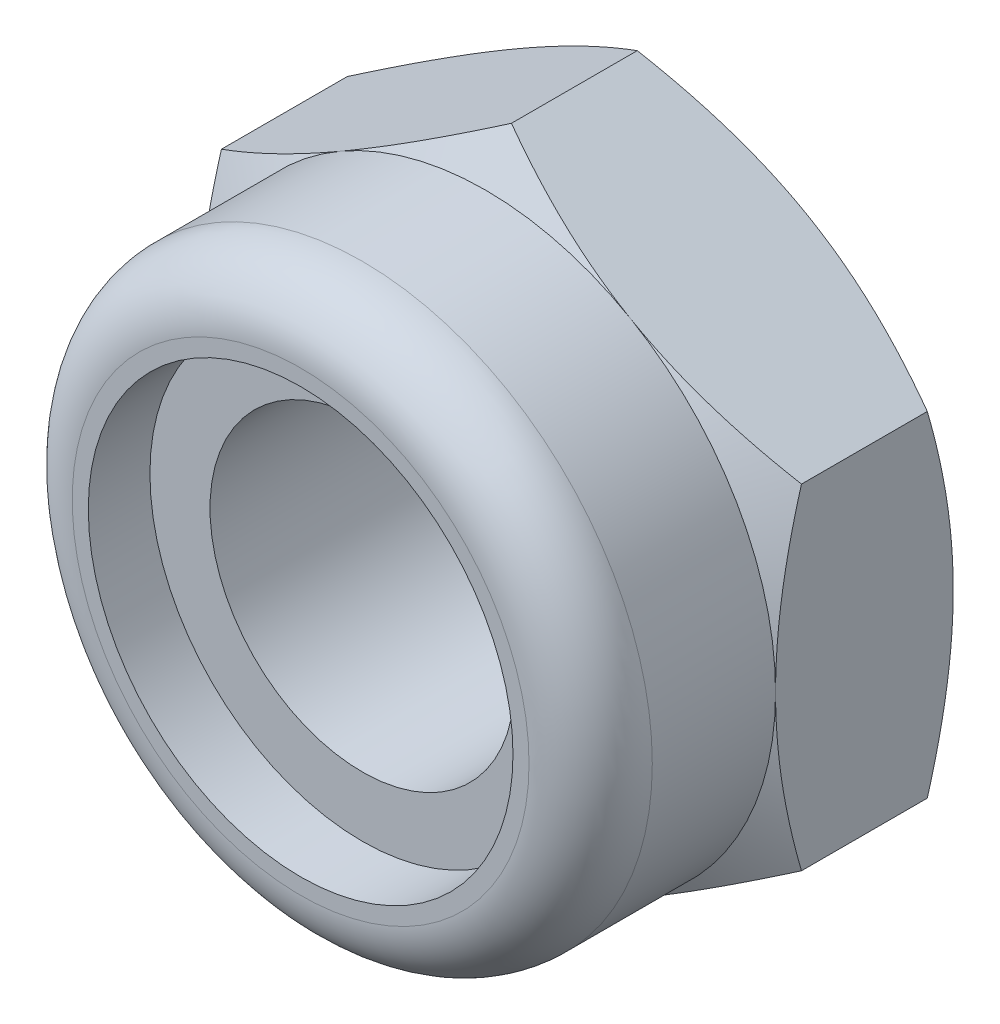
ISO-10303-21;
HEADER;
FILE_DESCRIPTION(('STEP AP214'),'2;1');
FILE_NAME('part.step','',(''),(''),'','','');
FILE_SCHEMA(('AUTOMOTIVE_DESIGN { 1 0 10303 214 1 1 1 1 }'));
ENDSEC;
DATA;
#1=APPLICATION_CONTEXT('core data for automotive mechanical design processes');
#2=APPLICATION_PROTOCOL_DEFINITION('international standard','automotive_design',2000,#1);
#3=PRODUCT_CONTEXT('',#1,'mechanical');
#4=PRODUCT('Part','Part','',(#3));
#5=PRODUCT_RELATED_PRODUCT_CATEGORY('part','',(#4));
#6=PRODUCT_DEFINITION_FORMATION('','',#4);
#7=PRODUCT_DEFINITION_CONTEXT('part definition',#1,'design');
#8=PRODUCT_DEFINITION('design','',#6,#7);
#9=PRODUCT_DEFINITION_SHAPE('','',#8);
#10=(LENGTH_UNIT() NAMED_UNIT(*) SI_UNIT(.MILLI.,.METRE.));
#11=(NAMED_UNIT(*) PLANE_ANGLE_UNIT() SI_UNIT($,.RADIAN.));
#12=(NAMED_UNIT(*) SI_UNIT($,.STERADIAN.) SOLID_ANGLE_UNIT());
#13=UNCERTAINTY_MEASURE_WITH_UNIT(LENGTH_MEASURE(1.E-05),#10,'distance_accuracy_value','');
#14=(GEOMETRIC_REPRESENTATION_CONTEXT(3) GLOBAL_UNCERTAINTY_ASSIGNED_CONTEXT((#13)) GLOBAL_UNIT_ASSIGNED_CONTEXT((#10,
#11,#12)) REPRESENTATION_CONTEXT('',''));
#15=CARTESIAN_POINT('',(0.,0.,0.));
#16=DIRECTION('',(0.,0.,1.));
#17=DIRECTION('',(1.,0.,0.));
#18=AXIS2_PLACEMENT_3D('',#15,#16,#17);
#19=CARTESIAN_POINT('',(0.,0.,-2.45));
#20=DIRECTION('',(0.,0.,1.));
#21=DIRECTION('',(1.,0.,0.));
#22=AXIS2_PLACEMENT_3D('',#19,#20,#21);
#23=CYLINDRICAL_SURFACE('',#22,2.1);
#24=CARTESIAN_POINT('',(0.,0.,1.7));
#25=DIRECTION('',(0.,0.,1.));
#26=DIRECTION('',(1.,0.,0.));
#27=AXIS2_PLACEMENT_3D('',#24,#25,#26);
#28=CIRCLE('',#27,2.1);
#29=CARTESIAN_POINT('',(2.1,0.,1.7));
#30=VERTEX_POINT('',#29);
#31=EDGE_CURVE('E267',#30,#30,#28,.T.);
#32=ORIENTED_EDGE('',*,*,#31,.T.);
#33=EDGE_LOOP('',(#32));
#34=FACE_BOUND('',#33,.T.);
#35=CARTESIAN_POINT('',(0.,0.,-2.14451698471612));
#36=DIRECTION('',(0.,0.,-1.));
#37=DIRECTION('',(-1.,0.,0.));
#38=AXIS2_PLACEMENT_3D('',#35,#36,#37);
#39=CIRCLE('',#38,2.1);
#40=CARTESIAN_POINT('',(-2.1,0.,-2.14451698471612));
#41=VERTEX_POINT('',#40);
#42=EDGE_CURVE('E21',#41,#41,#39,.F.);
#43=ORIENTED_EDGE('',*,*,#42,.F.);
#44=EDGE_LOOP('',(#43));
#45=FACE_BOUND('',#44,.T.);
#46=ADVANCED_FACE('F16',(#34,#45),#23,.F.);
#47=CARTESIAN_POINT('',(-8.,0.,-2.45));
#48=DIRECTION('',(0.,0.,1.));
#49=DIRECTION('',(1.,0.,0.));
#50=AXIS2_PLACEMENT_3D('',#47,#48,#49);
#51=PLANE('',#50);
#52=CARTESIAN_POINT('',(0.,0.,-2.45));
#53=DIRECTION('',(0.,0.,1.));
#54=DIRECTION('',(1.,0.,0.));
#55=AXIS2_PLACEMENT_3D('',#52,#53,#54);
#56=CIRCLE('',#55,4.);
#57=CARTESIAN_POINT('',(4.,0.,-2.45));
#58=VERTEX_POINT('',#57);
#59=CARTESIAN_POINT('',(2.,3.46410161513775,-2.45));
#60=VERTEX_POINT('',#59);
#61=EDGE_CURVE('E201',#58,#60,#56,.T.);
#62=ORIENTED_EDGE('',*,*,#61,.F.);
#63=CARTESIAN_POINT('',(0.,0.,-2.45));
#64=DIRECTION('',(0.,0.,1.));
#65=DIRECTION('',(1.,0.,0.));
#66=AXIS2_PLACEMENT_3D('',#63,#64,#65);
#67=CIRCLE('',#66,4.);
#68=CARTESIAN_POINT('',(2.,-3.46410161513775,-2.45));
#69=VERTEX_POINT('',#68);
#70=EDGE_CURVE('E243',#58,#69,#67,.F.);
#71=ORIENTED_EDGE('',*,*,#70,.T.);
#72=CARTESIAN_POINT('',(-2.,-3.46410161513775,-2.45));
#73=VERTEX_POINT('',#72);
#74=EDGE_CURVE('E245',#69,#73,#67,.F.);
#75=ORIENTED_EDGE('',*,*,#74,.T.);
#76=CARTESIAN_POINT('',(-4.,0.,-2.45));
#77=VERTEX_POINT('',#76);
#78=EDGE_CURVE('E568',#73,#77,#67,.F.);
#79=ORIENTED_EDGE('',*,*,#78,.T.);
#80=CARTESIAN_POINT('',(-2.,3.46410161513775,-2.45));
#81=VERTEX_POINT('',#80);
#82=EDGE_CURVE('E569',#77,#81,#67,.F.);
#83=ORIENTED_EDGE('',*,*,#82,.T.);
#84=EDGE_CURVE('E227',#81,#60,#67,.F.);
#85=ORIENTED_EDGE('',*,*,#84,.T.);
#86=EDGE_LOOP('',(#62,#71,#75,#79,#83,#85));
#87=FACE_BOUND('',#86,.T.);
#88=CARTESIAN_POINT('',(0.,0.,-2.45));
#89=DIRECTION('',(0.,0.,1.));
#90=DIRECTION('',(1.,0.,0.));
#91=AXIS2_PLACEMENT_3D('',#88,#89,#90);
#92=CIRCLE('',#91,2.5);
#93=CARTESIAN_POINT('',(2.5,0.,-2.45));
#94=VERTEX_POINT('',#93);
#95=EDGE_CURVE('E140',#94,#94,#92,.F.);
#96=ORIENTED_EDGE('',*,*,#95,.F.);
#97=EDGE_LOOP('',(#96));
#98=FACE_BOUND('',#97,.T.);
#99=ADVANCED_FACE('F207',(#87,#98),#51,.F.);
#100=CARTESIAN_POINT('',(0.,4.61880215351701,-2.45));
#101=DIRECTION('',(-0.5,0.866025403784439,0.));
#102=DIRECTION('',(-0.866025403784438,-0.5,0.));
#103=AXIS2_PLACEMENT_3D('',#100,#101,#102);
#104=PLANE('',#103);
#105=DIRECTION('',(0.,0.,1.));
#106=VECTOR('',#105,1.);
#107=CARTESIAN_POINT('',(-4.,2.3094010767585,-2.45));
#108=LINE('',#107,#106);
#109=CARTESIAN_POINT('',(-4.,2.30940107675851,-2.09273441009183));
#110=VERTEX_POINT('',#109);
#111=CARTESIAN_POINT('',(-4.,2.3094010767585,-0.357265589908164));
#112=VERTEX_POINT('',#111);
#113=EDGE_CURVE('E239',#110,#112,#108,.T.);
#114=ORIENTED_EDGE('',*,*,#113,.T.);
#115=CARTESIAN_POINT('',(-4.0002,2.30928560670467,-0.357332259074768));
#116=CARTESIAN_POINT('',(-3.82442084967677,2.41077174646171,-0.298717873648285));
#117=CARTESIAN_POINT('',(-3.64712438367362,2.513133908835,-0.245410321462265));
#118=CARTESIAN_POINT('',(-3.28946140682429,2.71963072479812,-0.152361670746405));
#119=CARTESIAN_POINT('',(-3.10908854102985,2.82376904741905,-0.112653489029706));
#120=CARTESIAN_POINT('',(-2.75057818129721,3.03075510011795,-0.0508422152802807));
#121=CARTESIAN_POINT('',(-2.57249584706486,3.13357098372492,-0.028327731522891));
#122=CARTESIAN_POINT('',(-2.21549328283349,3.33968651028529,-0.00145062314658269));
#123=CARTESIAN_POINT('',(-2.0365743503559,3.44298540411434,0.00293425857305784));
#124=CARTESIAN_POINT('',(-1.70225715780327,3.63600352522933,-0.00619007293996948));
#125=CARTESIAN_POINT('',(-1.54680884001293,3.72575165335065,-0.0174589539879952));
#126=CARTESIAN_POINT('',(-1.23692494436494,3.90466320392055,-0.0531739907981954));
#127=CARTESIAN_POINT('',(-1.08249043825587,3.99382600759479,-0.077632345711535));
#128=CARTESIAN_POINT('',(-0.771967672225421,4.17310641015197,-0.138776064919291));
#129=CARTESIAN_POINT('',(-0.615918711936897,4.26320131938131,-0.175720603654866));
#130=CARTESIAN_POINT('',(-0.30614816459616,4.44204742827551,-0.25957007254803));
#131=CARTESIAN_POINT('',(-0.15242260922622,4.53080091904967,-0.306455302212743));
#132=CARTESIAN_POINT('',(0.000200000000000402,4.61891762357085,-0.35733225907477));
#133=B_SPLINE_CURVE_WITH_KNOTS('',3,(#115,#116,#117,#118,#119,#120,#121,#122,#123,#124,#125,
#126,#127,#128,#129,#130,#131,#132),.UNSPECIFIED.,.F.,.F.,(4,2,2,2,2,2,2,2,4),(0.,
0.634047835695966,1.26961969224543,1.88946157213122,2.50854226669297,3.04757825393386,
3.58711366126904,4.13861653143764,4.68903648037743),.UNSPECIFIED.);
#134=CARTESIAN_POINT('',(-2.,3.46410161513775,0.));
#135=VERTEX_POINT('',#134);
#136=EDGE_CURVE('E43',#112,#135,#133,.T.);
#137=ORIENTED_EDGE('',*,*,#136,.T.);
#138=CARTESIAN_POINT('',(0.,4.61880215351701,-0.357265589908165));
#139=VERTEX_POINT('',#138);
#140=EDGE_CURVE('E122',#135,#139,#133,.T.);
#141=ORIENTED_EDGE('',*,*,#140,.T.);
#142=DIRECTION('',(0.,0.,1.));
#143=VECTOR('',#142,1.);
#144=CARTESIAN_POINT('',(0.,4.61880215351701,-2.45));
#145=LINE('',#144,#143);
#146=CARTESIAN_POINT('',(0.,4.61880215351701,-2.09273441009183));
#147=VERTEX_POINT('',#146);
#148=EDGE_CURVE('E119',#147,#139,#145,.T.);
#149=ORIENTED_EDGE('',*,*,#148,.F.);
#150=CARTESIAN_POINT('',(-4.0002,2.30928560670467,-2.09266774092523));
#151=CARTESIAN_POINT('',(-3.82442084967677,2.41077174646171,-2.15128212635172));
#152=CARTESIAN_POINT('',(-3.64712438367362,2.513133908835,-2.20458967853774));
#153=CARTESIAN_POINT('',(-3.28946140682429,2.71963072479812,-2.29763832925359));
#154=CARTESIAN_POINT('',(-3.10908854102985,2.82376904741905,-2.33734651097029));
#155=CARTESIAN_POINT('',(-2.75057818129721,3.03075510011795,-2.39915778471972));
#156=CARTESIAN_POINT('',(-2.57249584706486,3.13357098372492,-2.42167226847711));
#157=CARTESIAN_POINT('',(-2.21549328283349,3.33968651028529,-2.44854937685342));
#158=CARTESIAN_POINT('',(-2.0365743503559,3.44298540411434,-2.45293425857306));
#159=CARTESIAN_POINT('',(-1.70225715780327,3.63600352522933,-2.44380992706003));
#160=CARTESIAN_POINT('',(-1.54680884001293,3.72575165335065,-2.43254104601201));
#161=CARTESIAN_POINT('',(-1.23692494436494,3.90466320392055,-2.3968260092018));
#162=CARTESIAN_POINT('',(-1.08249043825587,3.99382600759479,-2.37236765428846));
#163=CARTESIAN_POINT('',(-0.771967672225421,4.17310641015197,-2.31122393508071));
#164=CARTESIAN_POINT('',(-0.615918711936897,4.26320131938131,-2.27427939634513));
#165=CARTESIAN_POINT('',(-0.306148164596159,4.44204742827551,-2.19042992745197));
#166=CARTESIAN_POINT('',(-0.15242260922622,4.53080091904967,-2.14354469778726));
#167=CARTESIAN_POINT('',(0.000200000000000404,4.61891762357085,-2.09266774092523));
#168=B_SPLINE_CURVE_WITH_KNOTS('',3,(#150,#151,#152,#153,#154,#155,#156,#157,#158,#159,#160,
#161,#162,#163,#164,#165,#166,#167),.UNSPECIFIED.,.F.,.F.,(4,2,2,2,2,2,2,2,4),(0.,
0.634047835695966,1.26961969224543,1.88946157213122,2.50854226669297,3.04757825393386,
3.58711366126904,4.13861653143764,4.68903648037743),.UNSPECIFIED.);
#169=EDGE_CURVE('E242',#81,#147,#168,.T.);
#170=ORIENTED_EDGE('',*,*,#169,.F.);
#171=EDGE_CURVE('E220',#110,#81,#168,.T.);
#172=ORIENTED_EDGE('',*,*,#171,.F.);
#173=EDGE_LOOP('',(#114,#137,#141,#149,#170,#172));
#174=FACE_BOUND('',#173,.T.);
#175=ADVANCED_FACE('F18',(#174),#104,.T.);
#176=CARTESIAN_POINT('',(4.,2.3094010767585,-2.45));
#177=DIRECTION('',(0.5,0.866025403784438,0.));
#178=DIRECTION('',(-0.866025403784438,0.5,0.));
#179=AXIS2_PLACEMENT_3D('',#176,#177,#178);
#180=PLANE('',#179);
#181=ORIENTED_EDGE('',*,*,#148,.T.);
#182=CARTESIAN_POINT('',(-0.000199999999999567,4.61891762357085,-0.35733225907477));
#183=CARTESIAN_POINT('',(0.175579150323227,4.51743148381381,-0.298717873648284));
#184=CARTESIAN_POINT('',(0.352875616326379,4.41506932144052,-0.245410321462263));
#185=CARTESIAN_POINT('',(0.710538593175704,4.20857250547739,-0.152361670746403));
#186=CARTESIAN_POINT('',(0.890911458970149,4.10443418285647,-0.112653489029704));
#187=CARTESIAN_POINT('',(1.24942181870279,3.89744813015756,-0.0508422152802783));
#188=CARTESIAN_POINT('',(1.42750415293514,3.79463224655059,-0.0283277315228876));
#189=CARTESIAN_POINT('',(1.78450671716651,3.58851671999023,-0.0014506231465804));
#190=CARTESIAN_POINT('',(1.9634256496441,3.48521782616117,0.00293425857305788));
#191=CARTESIAN_POINT('',(2.29774284219673,3.29219970504618,-0.00619007293996904));
#192=CARTESIAN_POINT('',(2.45319115998707,3.20245157692486,-0.0174589539879927));
#193=CARTESIAN_POINT('',(2.76307505563506,3.02354002635496,-0.0531739907981914));
#194=CARTESIAN_POINT('',(2.91750956174413,2.93437722268072,-0.0776323457115314));
#195=CARTESIAN_POINT('',(3.22803232777458,2.75509682012354,-0.138776064919288));
#196=CARTESIAN_POINT('',(3.3840812880631,2.6650019108942,-0.175720603654862));
#197=CARTESIAN_POINT('',(3.69385183540384,2.486155802,-0.259570072548026));
#198=CARTESIAN_POINT('',(3.84757739077378,2.39740231122585,-0.30645530221274));
#199=CARTESIAN_POINT('',(4.0002,2.30928560670467,-0.357332259074768));
#200=B_SPLINE_CURVE_WITH_KNOTS('',3,(#182,#183,#184,#185,#186,#187,#188,#189,#190,#191,#192,
#193,#194,#195,#196,#197,#198,#199),.UNSPECIFIED.,.F.,.F.,(4,2,2,2,2,2,2,2,4),(0.,
0.634047835695967,1.26961969224544,1.88946157213123,2.50854226669298,3.04757825393386,
3.58711366126904,4.13861653143764,4.68903648037744),.UNSPECIFIED.);
#201=CARTESIAN_POINT('',(2.,3.46410161513775,0.));
#202=VERTEX_POINT('',#201);
#203=EDGE_CURVE('E111',#139,#202,#200,.T.);
#204=ORIENTED_EDGE('',*,*,#203,.T.);
#205=CARTESIAN_POINT('',(4.,2.30940107675851,-0.357265589908165));
#206=VERTEX_POINT('',#205);
#207=EDGE_CURVE('E115',#202,#206,#200,.T.);
#208=ORIENTED_EDGE('',*,*,#207,.T.);
#209=DIRECTION('',(0.,0.,1.));
#210=VECTOR('',#209,1.);
#211=CARTESIAN_POINT('',(4.,2.3094010767585,-2.45));
#212=LINE('',#211,#210);
#213=CARTESIAN_POINT('',(4.,2.30940107675851,-2.09273441009183));
#214=VERTEX_POINT('',#213);
#215=EDGE_CURVE('E228',#214,#206,#212,.T.);
#216=ORIENTED_EDGE('',*,*,#215,.F.);
#217=CARTESIAN_POINT('',(-0.000199999999999567,4.61891762357085,-2.09266774092523));
#218=CARTESIAN_POINT('',(0.175579150323226,4.51743148381381,-2.15128212635172));
#219=CARTESIAN_POINT('',(0.352875616326378,4.41506932144052,-2.20458967853774));
#220=CARTESIAN_POINT('',(0.710538593175704,4.20857250547739,-2.2976383292536));
#221=CARTESIAN_POINT('',(0.890911458970149,4.10443418285647,-2.3373465109703));
#222=CARTESIAN_POINT('',(1.24942181870279,3.89744813015756,-2.39915778471972));
#223=CARTESIAN_POINT('',(1.42750415293514,3.79463224655059,-2.42167226847711));
#224=CARTESIAN_POINT('',(1.78450671716651,3.58851671999023,-2.44854937685342));
#225=CARTESIAN_POINT('',(1.9634256496441,3.48521782616117,-2.45293425857306));
#226=CARTESIAN_POINT('',(2.29774284219673,3.29219970504618,-2.44380992706003));
#227=CARTESIAN_POINT('',(2.45319115998707,3.20245157692486,-2.43254104601201));
#228=CARTESIAN_POINT('',(2.76307505563506,3.02354002635496,-2.39682600920181));
#229=CARTESIAN_POINT('',(2.91750956174413,2.93437722268072,-2.37236765428847));
#230=CARTESIAN_POINT('',(3.22803232777458,2.75509682012354,-2.31122393508071));
#231=CARTESIAN_POINT('',(3.3840812880631,2.6650019108942,-2.27427939634514));
#232=CARTESIAN_POINT('',(3.69385183540384,2.486155802,-2.19042992745197));
#233=CARTESIAN_POINT('',(3.84757739077378,2.39740231122585,-2.14354469778726));
#234=CARTESIAN_POINT('',(4.0002,2.30928560670467,-2.09266774092523));
#235=B_SPLINE_CURVE_WITH_KNOTS('',3,(#217,#218,#219,#220,#221,#222,#223,#224,#225,#226,#227,
#228,#229,#230,#231,#232,#233,#234),.UNSPECIFIED.,.F.,.F.,(4,2,2,2,2,2,2,2,4),(0.,
0.634047835695967,1.26961969224544,1.88946157213123,2.50854226669298,3.04757825393386,
3.58711366126904,4.13861653143764,4.68903648037743),.UNSPECIFIED.);
#236=EDGE_CURVE('E211',#60,#214,#235,.T.);
#237=ORIENTED_EDGE('',*,*,#236,.F.);
#238=EDGE_CURVE('E218',#147,#60,#235,.T.);
#239=ORIENTED_EDGE('',*,*,#238,.F.);
#240=EDGE_LOOP('',(#181,#204,#208,#216,#237,#239));
#241=FACE_BOUND('',#240,.T.);
#242=ADVANCED_FACE('F113',(#241),#180,.T.);
#243=CARTESIAN_POINT('',(4.,2.3094010767585,-2.45));
#244=DIRECTION('',(-1.,0.,0.));
#245=DIRECTION('',(0.,0.,1.));
#246=AXIS2_PLACEMENT_3D('',#243,#244,#245);
#247=PLANE('',#246);
#248=CARTESIAN_POINT('',(4.,-6.12487198995892,-1.91410682124064));
#249=CARTESIAN_POINT('',(4.,-5.94924937038676,-1.8292362707669));
#250=CARTESIAN_POINT('',(4.,-5.77321152095286,-1.7452094038074));
#251=CARTESIAN_POINT('',(4.,-5.42008084777955,-1.57932514679716));
#252=CARTESIAN_POINT('',(4.,-5.24298784779928,-1.49746813236723));
#253=CARTESIAN_POINT('',(4.,-4.88656571686334,-1.33597446305856));
#254=CARTESIAN_POINT('',(4.,-4.70722958889362,-1.25635319506304));
#255=CARTESIAN_POINT('',(4.,-4.34708334747264,-1.1005305854203));
#256=CARTESIAN_POINT('',(4.,-4.16627331143538,-1.02432906550802));
#257=CARTESIAN_POINT('',(4.,-3.80064706744978,-0.875350650394362));
#258=CARTESIAN_POINT('',(4.,-3.6158089282277,-0.802627284215845));
#259=CARTESIAN_POINT('',(4.,-3.24395246794969,-0.66287623095942));
#260=CARTESIAN_POINT('',(4.,-3.05693390695801,-0.595849177566505));
#261=CARTESIAN_POINT('',(4.,-2.68080318253771,-0.469291748430882));
#262=CARTESIAN_POINT('',(4.,-2.49169643712849,-0.409745434783837));
#263=CARTESIAN_POINT('',(4.,-2.11079454635851,-0.300083356544506));
#264=CARTESIAN_POINT('',(4.,-1.91900027185749,-0.249964609676752));
#265=CARTESIAN_POINT('',(4.,-1.532592326982,-0.161590794954042));
#266=CARTESIAN_POINT('',(4.,-1.3379779203165,-0.12333888595654));
#267=CARTESIAN_POINT('',(4.,-0.946402725872554,-0.0612742359223434));
#268=CARTESIAN_POINT('',(4.,-0.749441936019774,-0.0374615076516987));
#269=CARTESIAN_POINT('',(4.,-0.355451989627943,-0.00638181314943619));
#270=CARTESIAN_POINT('',(4.,-0.158431311094011,0.000989900761041109));
#271=CARTESIAN_POINT('',(4.,0.235472085607469,-0.00120406637479564));
#272=CARTESIAN_POINT('',(4.,0.432354826312205,-0.0107653508153502));
#273=CARTESIAN_POINT('',(4.,0.768560635225517,-0.0408787346135905));
#274=CARTESIAN_POINT('',(4.,0.90825461838182,-0.0575092960439101));
#275=CARTESIAN_POINT('',(4.,1.18656349063497,-0.0982134103466924));
#276=CARTESIAN_POINT('',(4.,1.32517820601013,-0.122288137058447));
#277=CARTESIAN_POINT('',(4.,1.73929045452969,-0.204415070950231));
#278=CARTESIAN_POINT('',(4.,2.01284690528722,-0.272348886425153));
#279=CARTESIAN_POINT('',(4.,2.42218253014524,-0.389516359317204));
#280=CARTESIAN_POINT('',(4.,2.56009536361538,-0.431713941811636));
#281=CARTESIAN_POINT('',(4.,2.83448159101404,-0.520284580227762));
#282=CARTESIAN_POINT('',(4.,2.97095590623557,-0.566654756186912));
#283=CARTESIAN_POINT('',(4.,3.24189440516341,-0.662605699180286));
#284=CARTESIAN_POINT('',(4.,3.37636557946838,-0.7121669257535));
#285=CARTESIAN_POINT('',(4.,3.64426461152914,-0.814198353790702));
#286=CARTESIAN_POINT('',(4.,3.77769202239387,-0.866669730963369));
#287=CARTESIAN_POINT('',(4.,3.91063698986684,-0.920309006541793));
#288=B_SPLINE_CURVE_WITH_KNOTS('',3,(#248,#249,#250,#251,#252,#253,#254,#255,#256,#257,#258,
#259,#260,#261,#262,#263,#264,#265,#266,#267,#268,#269,#270,#271,#272,#273,#274,#275,#276,#277,
#278,#279,#280,#281,#282,#283,#284,#285,#286,#287),.UNSPECIFIED.,.F.,.F.,(4,2,2,2,2,2,2,2,2,2,2,
2,2,2,2,2,2,2,2,4),(0.,0.585171792532269,1.17044423059927,1.7590659464599,2.34765694284827,
2.94347400997483,3.53935727210689,4.133948646976,4.72835161391471,5.32291267067845,
5.91747425310813,6.50823685854037,7.09884609659886,7.52068140825521,7.9425832713084,
8.7870149135983,9.21965281897689,9.65199437116298,10.0819024146297,10.5119854255247),.UNSPECIFIED.);
#289=CARTESIAN_POINT('',(4.,-2.30940107675851,-0.357265589908165));
#290=VERTEX_POINT('',#289);
#291=CARTESIAN_POINT('',(4.,0.,0.));
#292=VERTEX_POINT('',#291);
#293=EDGE_CURVE('E184',#290,#292,#288,.T.);
#294=ORIENTED_EDGE('',*,*,#293,.F.);
#295=DIRECTION('',(0.,0.,1.));
#296=VECTOR('',#295,1.);
#297=CARTESIAN_POINT('',(4.,-2.30940107675851,-2.45));
#298=LINE('',#297,#296);
#299=CARTESIAN_POINT('',(4.,-2.30940107675851,-2.09273441009183));
#300=VERTEX_POINT('',#299);
#301=EDGE_CURVE('E230',#300,#290,#298,.T.);
#302=ORIENTED_EDGE('',*,*,#301,.F.);
#303=CARTESIAN_POINT('',(4.,-6.12487198995892,-0.535893178759356));
#304=CARTESIAN_POINT('',(4.,-5.94924937038676,-0.6207637292331));
#305=CARTESIAN_POINT('',(4.,-5.77321152095286,-0.704790596192602));
#306=CARTESIAN_POINT('',(4.,-5.42008084777955,-0.870674853202837));
#307=CARTESIAN_POINT('',(4.,-5.24298784779928,-0.952531867632769));
#308=CARTESIAN_POINT('',(4.,-4.88656571686334,-1.11402553694144));
#309=CARTESIAN_POINT('',(4.,-4.70722958889362,-1.19364680493696));
#310=CARTESIAN_POINT('',(4.,-4.34708334747263,-1.3494694145797));
#311=CARTESIAN_POINT('',(4.,-4.16627331143538,-1.42567093449198));
#312=CARTESIAN_POINT('',(4.,-3.80064706744978,-1.57464934960564));
#313=CARTESIAN_POINT('',(4.,-3.6158089282277,-1.64737271578415));
#314=CARTESIAN_POINT('',(4.,-3.24395246794968,-1.78712376904058));
#315=CARTESIAN_POINT('',(4.,-3.05693390695801,-1.8541508224335));
#316=CARTESIAN_POINT('',(4.,-2.68080318253771,-1.98070825156912));
#317=CARTESIAN_POINT('',(4.,-2.49169643712849,-2.04025456521616));
#318=CARTESIAN_POINT('',(4.,-2.11079454635851,-2.14991664345549));
#319=CARTESIAN_POINT('',(4.,-1.91900027185749,-2.20003539032325));
#320=CARTESIAN_POINT('',(4.,-1.532592326982,-2.28840920504596));
#321=CARTESIAN_POINT('',(4.,-1.3379779203165,-2.32666111404346));
#322=CARTESIAN_POINT('',(4.,-0.946402725872554,-2.38872576407766));
#323=CARTESIAN_POINT('',(4.,-0.749441936019774,-2.4125384923483));
#324=CARTESIAN_POINT('',(4.,-0.355451989627943,-2.44361818685056));
#325=CARTESIAN_POINT('',(4.,-0.158431311094012,-2.45098990076104));
#326=CARTESIAN_POINT('',(4.,0.235472085607469,-2.44879593362521));
#327=CARTESIAN_POINT('',(4.,0.432354826312206,-2.43923464918465));
#328=CARTESIAN_POINT('',(4.,0.768560635225517,-2.40912126538641));
#329=CARTESIAN_POINT('',(4.,0.90825461838182,-2.39249070395609));
#330=CARTESIAN_POINT('',(4.,1.18656349063497,-2.35178658965331));
#331=CARTESIAN_POINT('',(4.,1.32517820601013,-2.32771186294155));
#332=CARTESIAN_POINT('',(4.,1.73929045452969,-2.24558492904977));
#333=CARTESIAN_POINT('',(4.,2.01284690528722,-2.17765111357485));
#334=CARTESIAN_POINT('',(4.,2.42218253014524,-2.0604836406828));
#335=CARTESIAN_POINT('',(4.,2.56009536361538,-2.01828605818836));
#336=CARTESIAN_POINT('',(4.,2.83448159101404,-1.92971541977224));
#337=CARTESIAN_POINT('',(4.,2.97095590623557,-1.88334524381309));
#338=CARTESIAN_POINT('',(4.,3.24189440516341,-1.78739430081971));
#339=CARTESIAN_POINT('',(4.,3.37636557946838,-1.7378330742465));
#340=CARTESIAN_POINT('',(4.,3.64426461152914,-1.6358016462093));
#341=CARTESIAN_POINT('',(4.,3.77769202239387,-1.58333026903663));
#342=CARTESIAN_POINT('',(4.,3.91063698986684,-1.52969099345821));
#343=B_SPLINE_CURVE_WITH_KNOTS('',3,(#303,#304,#305,#306,#307,#308,#309,#310,#311,#312,#313,
#314,#315,#316,#317,#318,#319,#320,#321,#322,#323,#324,#325,#326,#327,#328,#329,#330,#331,#332,
#333,#334,#335,#336,#337,#338,#339,#340,#341,#342),.UNSPECIFIED.,.F.,.F.,(4,2,2,2,2,2,2,2,2,2,2,
2,2,2,2,2,2,2,2,4),(0.,0.585171792532271,1.17044423059927,1.7590659464599,2.34765694284827,
2.94347400997483,3.53935727210689,4.13394864697601,4.72835161391471,5.32291267067845,
5.91747425310813,6.50823685854037,7.09884609659886,7.52068140825521,7.9425832713084,
8.7870149135983,9.21965281897689,9.65199437116297,10.0819024146297,10.5119854255247),.UNSPECIFIED.);
#344=EDGE_CURVE('E311',#300,#58,#343,.T.);
#345=ORIENTED_EDGE('',*,*,#344,.T.);
#346=EDGE_CURVE('E219',#58,#214,#343,.T.);
#347=ORIENTED_EDGE('',*,*,#346,.T.);
#348=ORIENTED_EDGE('',*,*,#215,.T.);
#349=EDGE_CURVE('E129',#292,#206,#288,.T.);
#350=ORIENTED_EDGE('',*,*,#349,.F.);
#351=EDGE_LOOP('',(#294,#302,#345,#347,#348,#350));
#352=FACE_BOUND('',#351,.T.);
#353=ADVANCED_FACE('F206',(#352),#247,.F.);
#354=CARTESIAN_POINT('',(0.,-4.61880215351701,-2.45));
#355=DIRECTION('',(0.5,-0.866025403784439,0.));
#356=DIRECTION('',(0.866025403784438,0.5,0.));
#357=AXIS2_PLACEMENT_3D('',#354,#355,#356);
#358=PLANE('',#357);
#359=ORIENTED_EDGE('',*,*,#301,.T.);
#360=CARTESIAN_POINT('',(4.0002,-2.30928560670467,-0.35733225907477));
#361=CARTESIAN_POINT('',(3.82442084967677,-2.41077174646171,-0.298717873648285));
#362=CARTESIAN_POINT('',(3.64712438367362,-2.513133908835,-0.245410321462265));
#363=CARTESIAN_POINT('',(3.28946140682429,-2.71963072479812,-0.152361670746405));
#364=CARTESIAN_POINT('',(3.10908854102985,-2.82376904741905,-0.112653489029705));
#365=CARTESIAN_POINT('',(2.75057818129721,-3.03075510011796,-0.0508422152802799));
#366=CARTESIAN_POINT('',(2.57249584706486,-3.13357098372492,-0.0283277315228899));
#367=CARTESIAN_POINT('',(2.21549328283349,-3.33968651028529,-0.00145062314658358));
#368=CARTESIAN_POINT('',(2.0365743503559,-3.44298540411435,0.00293425857305454));
#369=CARTESIAN_POINT('',(1.70225715780327,-3.63600352522933,-0.00619007293997257));
#370=CARTESIAN_POINT('',(1.54680884001293,-3.72575165335065,-0.0174589539879962));
#371=CARTESIAN_POINT('',(1.23692494436494,-3.90466320392055,-0.0531739907981949));
#372=CARTESIAN_POINT('',(1.08249043825587,-3.99382600759479,-0.0776323457115349));
#373=CARTESIAN_POINT('',(0.77196767222542,-4.17310641015197,-0.138776064919292));
#374=CARTESIAN_POINT('',(0.615918711936896,-4.26320131938131,-0.175720603654866));
#375=CARTESIAN_POINT('',(0.306148164596159,-4.44204742827551,-0.259570072548031));
#376=CARTESIAN_POINT('',(0.152422609226219,-4.53080091904967,-0.306455302212745));
#377=CARTESIAN_POINT('',(-0.000200000000000206,-4.61891762357085,-0.357332259074773));
#378=B_SPLINE_CURVE_WITH_KNOTS('',3,(#360,#361,#362,#363,#364,#365,#366,#367,#368,#369,#370,
#371,#372,#373,#374,#375,#376,#377),.UNSPECIFIED.,.F.,.F.,(4,2,2,2,2,2,2,2,4),(0.,
0.634047835695967,1.26961969224543,1.88946157213122,2.50854226669297,3.04757825393386,
3.58711366126904,4.13861653143764,4.68903648037743),.UNSPECIFIED.);
#379=CARTESIAN_POINT('',(2.,-3.46410161513775,0.));
#380=VERTEX_POINT('',#379);
#381=EDGE_CURVE('E357',#290,#380,#378,.T.);
#382=ORIENTED_EDGE('',*,*,#381,.T.);
#383=CARTESIAN_POINT('',(0.,-4.61880215351701,-0.357265589908165));
#384=VERTEX_POINT('',#383);
#385=EDGE_CURVE('E177',#380,#384,#378,.T.);
#386=ORIENTED_EDGE('',*,*,#385,.T.);
#387=DIRECTION('',(0.,0.,1.));
#388=VECTOR('',#387,1.);
#389=CARTESIAN_POINT('',(0.,-4.61880215351701,-2.45));
#390=LINE('',#389,#388);
#391=CARTESIAN_POINT('',(0.,-4.61880215351701,-2.09273441009183));
#392=VERTEX_POINT('',#391);
#393=EDGE_CURVE('E233',#392,#384,#390,.T.);
#394=ORIENTED_EDGE('',*,*,#393,.F.);
#395=CARTESIAN_POINT('',(4.0002,-2.30928560670467,-2.09266774092523));
#396=CARTESIAN_POINT('',(3.82442084967677,-2.41077174646171,-2.15128212635171));
#397=CARTESIAN_POINT('',(3.64712438367362,-2.513133908835,-2.20458967853773));
#398=CARTESIAN_POINT('',(3.28946140682429,-2.71963072479812,-2.29763832925359));
#399=CARTESIAN_POINT('',(3.10908854102985,-2.82376904741905,-2.33734651097029));
#400=CARTESIAN_POINT('',(2.75057818129721,-3.03075510011796,-2.39915778471972));
#401=CARTESIAN_POINT('',(2.57249584706486,-3.13357098372492,-2.42167226847711));
#402=CARTESIAN_POINT('',(2.21549328283349,-3.33968651028529,-2.44854937685342));
#403=CARTESIAN_POINT('',(2.0365743503559,-3.44298540411435,-2.45293425857306));
#404=CARTESIAN_POINT('',(1.70225715780327,-3.63600352522933,-2.44380992706003));
#405=CARTESIAN_POINT('',(1.54680884001293,-3.72575165335065,-2.432541046012));
#406=CARTESIAN_POINT('',(1.23692494436494,-3.90466320392055,-2.3968260092018));
#407=CARTESIAN_POINT('',(1.08249043825587,-3.99382600759479,-2.37236765428846));
#408=CARTESIAN_POINT('',(0.77196767222542,-4.17310641015198,-2.31122393508071));
#409=CARTESIAN_POINT('',(0.615918711936895,-4.26320131938131,-2.27427939634513));
#410=CARTESIAN_POINT('',(0.306148164596158,-4.44204742827551,-2.19042992745197));
#411=CARTESIAN_POINT('',(0.152422609226219,-4.53080091904967,-2.14354469778725));
#412=CARTESIAN_POINT('',(-0.000200000000000204,-4.61891762357085,-2.09266774092523));
#413=B_SPLINE_CURVE_WITH_KNOTS('',3,(#395,#396,#397,#398,#399,#400,#401,#402,#403,#404,#405,
#406,#407,#408,#409,#410,#411,#412),.UNSPECIFIED.,.F.,.F.,(4,2,2,2,2,2,2,2,4),(0.,
0.634047835695967,1.26961969224543,1.88946157213122,2.50854226669297,3.04757825393386,
3.58711366126904,4.13861653143764,4.68903648037743),.UNSPECIFIED.);
#414=EDGE_CURVE('E316',#69,#392,#413,.T.);
#415=ORIENTED_EDGE('',*,*,#414,.F.);
#416=EDGE_CURVE('E315',#300,#69,#413,.T.);
#417=ORIENTED_EDGE('',*,*,#416,.F.);
#418=EDGE_LOOP('',(#359,#382,#386,#394,#415,#417));
#419=FACE_BOUND('',#418,.T.);
#420=ADVANCED_FACE('F333',(#419),#358,.T.);
#421=CARTESIAN_POINT('',(-4.,-2.30940107675851,-2.45));
#422=DIRECTION('',(-0.5,-0.866025403784438,0.));
#423=DIRECTION('',(0.866025403784438,-0.5,0.));
#424=AXIS2_PLACEMENT_3D('',#421,#422,#423);
#425=PLANE('',#424);
#426=ORIENTED_EDGE('',*,*,#393,.T.);
#427=CARTESIAN_POINT('',(0.00019999999999975,-4.61891762357085,-0.357332259074773));
#428=CARTESIAN_POINT('',(-0.175579150323227,-4.51743148381381,-0.298717873648287));
#429=CARTESIAN_POINT('',(-0.35287561632638,-4.41506932144052,-0.245410321462266));
#430=CARTESIAN_POINT('',(-0.710538593175707,-4.2085725054774,-0.152361670746405));
#431=CARTESIAN_POINT('',(-0.890911458970152,-4.10443418285647,-0.112653489029706));
#432=CARTESIAN_POINT('',(-1.24942181870279,-3.89744813015756,-0.0508422152802806));
#433=CARTESIAN_POINT('',(-1.42750415293514,-3.7946322465506,-0.0283277315228903));
#434=CARTESIAN_POINT('',(-1.78450671716651,-3.58851671999023,-0.00145062314658345));
#435=CARTESIAN_POINT('',(-1.9634256496441,-3.48521782616117,0.00293425857305489));
#436=CARTESIAN_POINT('',(-2.29774284219674,-3.29219970504619,-0.00619007293997203));
#437=CARTESIAN_POINT('',(-2.45319115998707,-3.20245157692486,-0.0174589539879956));
#438=CARTESIAN_POINT('',(-2.76307505563506,-3.02354002635497,-0.0531739907981942));
#439=CARTESIAN_POINT('',(-2.91750956174413,-2.93437722268073,-0.0776323457115341));
#440=CARTESIAN_POINT('',(-3.22803232777458,-2.75509682012354,-0.13877606491929));
#441=CARTESIAN_POINT('',(-3.3840812880631,-2.6650019108942,-0.175720603654865));
#442=CARTESIAN_POINT('',(-3.69385183540384,-2.48615580200001,-0.259570072548029));
#443=CARTESIAN_POINT('',(-3.84757739077378,-2.39740231122585,-0.306455302212742));
#444=CARTESIAN_POINT('',(-4.0002,-2.30928560670467,-0.35733225907477));
#445=B_SPLINE_CURVE_WITH_KNOTS('',3,(#427,#428,#429,#430,#431,#432,#433,#434,#435,#436,#437,
#438,#439,#440,#441,#442,#443,#444),.UNSPECIFIED.,.F.,.F.,(4,2,2,2,2,2,2,2,4),(0.,
0.634047835695968,1.26961969224544,1.88946157213123,2.50854226669298,3.04757825393386,
3.58711366126904,4.13861653143764,4.68903648037743),.UNSPECIFIED.);
#446=CARTESIAN_POINT('',(-2.,-3.46410161513775,0.));
#447=VERTEX_POINT('',#446);
#448=EDGE_CURVE('E352',#384,#447,#445,.T.);
#449=ORIENTED_EDGE('',*,*,#448,.T.);
#450=CARTESIAN_POINT('',(-4.,-2.30940107675851,-0.357265589908165));
#451=VERTEX_POINT('',#450);
#452=EDGE_CURVE('E150',#447,#451,#445,.T.);
#453=ORIENTED_EDGE('',*,*,#452,.T.);
#454=DIRECTION('',(0.,0.,1.));
#455=VECTOR('',#454,1.);
#456=CARTESIAN_POINT('',(-4.,-2.30940107675851,-2.45));
#457=LINE('',#456,#455);
#458=CARTESIAN_POINT('',(-4.,-2.30940107675851,-2.09273441009183));
#459=VERTEX_POINT('',#458);
#460=EDGE_CURVE('E236',#459,#451,#457,.T.);
#461=ORIENTED_EDGE('',*,*,#460,.F.);
#462=CARTESIAN_POINT('',(0.00019999999999975,-4.61891762357085,-2.09266774092523));
#463=CARTESIAN_POINT('',(-0.175579150323227,-4.51743148381381,-2.15128212635171));
#464=CARTESIAN_POINT('',(-0.35287561632638,-4.41506932144052,-2.20458967853773));
#465=CARTESIAN_POINT('',(-0.710538593175706,-4.2085725054774,-2.29763832925359));
#466=CARTESIAN_POINT('',(-0.890911458970152,-4.10443418285647,-2.33734651097029));
#467=CARTESIAN_POINT('',(-1.24942181870279,-3.89744813015756,-2.39915778471972));
#468=CARTESIAN_POINT('',(-1.42750415293514,-3.7946322465506,-2.42167226847711));
#469=CARTESIAN_POINT('',(-1.78450671716651,-3.58851671999023,-2.44854937685342));
#470=CARTESIAN_POINT('',(-1.9634256496441,-3.48521782616117,-2.45293425857306));
#471=CARTESIAN_POINT('',(-2.29774284219674,-3.29219970504619,-2.44380992706003));
#472=CARTESIAN_POINT('',(-2.45319115998707,-3.20245157692486,-2.432541046012));
#473=CARTESIAN_POINT('',(-2.76307505563506,-3.02354002635497,-2.39682600920181));
#474=CARTESIAN_POINT('',(-2.91750956174413,-2.93437722268073,-2.37236765428847));
#475=CARTESIAN_POINT('',(-3.22803232777458,-2.75509682012354,-2.31122393508071));
#476=CARTESIAN_POINT('',(-3.3840812880631,-2.6650019108942,-2.27427939634514));
#477=CARTESIAN_POINT('',(-3.69385183540384,-2.48615580200001,-2.19042992745197));
#478=CARTESIAN_POINT('',(-3.84757739077378,-2.39740231122585,-2.14354469778726));
#479=CARTESIAN_POINT('',(-4.0002,-2.30928560670467,-2.09266774092523));
#480=B_SPLINE_CURVE_WITH_KNOTS('',3,(#462,#463,#464,#465,#466,#467,#468,#469,#470,#471,#472,
#473,#474,#475,#476,#477,#478,#479),.UNSPECIFIED.,.F.,.F.,(4,2,2,2,2,2,2,2,4),(0.,
0.634047835695968,1.26961969224544,1.88946157213123,2.50854226669298,3.04757825393386,
3.58711366126904,4.13861653143764,4.68903648037743),.UNSPECIFIED.);
#481=EDGE_CURVE('E328',#73,#459,#480,.T.);
#482=ORIENTED_EDGE('',*,*,#481,.F.);
#483=EDGE_CURVE('E327',#392,#73,#480,.T.);
#484=ORIENTED_EDGE('',*,*,#483,.F.);
#485=EDGE_LOOP('',(#426,#449,#453,#461,#482,#484));
#486=FACE_BOUND('',#485,.T.);
#487=ADVANCED_FACE('F336',(#486),#425,.T.);
#488=CARTESIAN_POINT('',(-4.,2.3094010767585,-2.45));
#489=DIRECTION('',(-1.,0.,0.));
#490=DIRECTION('',(0.,0.,1.));
#491=AXIS2_PLACEMENT_3D('',#488,#489,#490);
#492=PLANE('',#491);
#493=ORIENTED_EDGE('',*,*,#460,.T.);
#494=CARTESIAN_POINT('',(-4.,-6.12487198995892,-1.91410682124064));
#495=CARTESIAN_POINT('',(-4.,-5.94924937038676,-1.8292362707669));
#496=CARTESIAN_POINT('',(-4.,-5.77321152095286,-1.7452094038074));
#497=CARTESIAN_POINT('',(-4.,-5.42008084777955,-1.57932514679716));
#498=CARTESIAN_POINT('',(-4.,-5.24298784779928,-1.49746813236723));
#499=CARTESIAN_POINT('',(-4.,-4.88656571686334,-1.33597446305856));
#500=CARTESIAN_POINT('',(-4.,-4.70722958889362,-1.25635319506304));
#501=CARTESIAN_POINT('',(-4.,-4.34708334747264,-1.1005305854203));
#502=CARTESIAN_POINT('',(-4.,-4.16627331143538,-1.02432906550802));
#503=CARTESIAN_POINT('',(-4.,-3.80064706744978,-0.875350650394362));
#504=CARTESIAN_POINT('',(-4.,-3.6158089282277,-0.802627284215845));
#505=CARTESIAN_POINT('',(-4.,-3.24395246794969,-0.66287623095942));
#506=CARTESIAN_POINT('',(-4.,-3.05693390695801,-0.595849177566505));
#507=CARTESIAN_POINT('',(-4.,-2.68080318253771,-0.469291748430882));
#508=CARTESIAN_POINT('',(-4.,-2.49169643712849,-0.409745434783838));
#509=CARTESIAN_POINT('',(-4.,-2.11079454635851,-0.300083356544506));
#510=CARTESIAN_POINT('',(-4.,-1.91900027185749,-0.249964609676752));
#511=CARTESIAN_POINT('',(-4.,-1.532592326982,-0.161590794954042));
#512=CARTESIAN_POINT('',(-4.,-1.3379779203165,-0.12333888595654));
#513=CARTESIAN_POINT('',(-4.,-0.946402725872554,-0.0612742359223435));
#514=CARTESIAN_POINT('',(-4.,-0.749441936019774,-0.0374615076516988));
#515=CARTESIAN_POINT('',(-4.,-0.355451989627943,-0.00638181314943611));
#516=CARTESIAN_POINT('',(-4.,-0.158431311094011,0.000989900761041277));
#517=CARTESIAN_POINT('',(-4.,0.235472085607469,-0.00120406637479581));
#518=CARTESIAN_POINT('',(-4.,0.432354826312206,-0.0107653508153508));
#519=CARTESIAN_POINT('',(-4.,0.768560635225518,-0.0408787346135909));
#520=CARTESIAN_POINT('',(-4.,0.908254618381821,-0.0575092960439101));
#521=CARTESIAN_POINT('',(-4.,1.18656349063497,-0.0982134103466924));
#522=CARTESIAN_POINT('',(-4.,1.32517820601013,-0.122288137058447));
#523=CARTESIAN_POINT('',(-4.,1.73929045452969,-0.204415070950232));
#524=CARTESIAN_POINT('',(-4.,2.01284690528722,-0.272348886425154));
#525=CARTESIAN_POINT('',(-4.,2.42218253014524,-0.389516359317204));
#526=CARTESIAN_POINT('',(-4.,2.56009536361539,-0.431713941811637));
#527=CARTESIAN_POINT('',(-4.,2.83448159101404,-0.520284580227763));
#528=CARTESIAN_POINT('',(-4.,2.97095590623557,-0.566654756186913));
#529=CARTESIAN_POINT('',(-4.,3.24189440516341,-0.662605699180287));
#530=CARTESIAN_POINT('',(-4.,3.37636557946838,-0.7121669257535));
#531=CARTESIAN_POINT('',(-4.,3.64426461152914,-0.814198353790702));
#532=CARTESIAN_POINT('',(-4.,3.77769202239387,-0.86666973096337));
#533=CARTESIAN_POINT('',(-4.,3.91063698986684,-0.920309006541794));
#534=B_SPLINE_CURVE_WITH_KNOTS('',3,(#494,#495,#496,#497,#498,#499,#500,#501,#502,#503,#504,
#505,#506,#507,#508,#509,#510,#511,#512,#513,#514,#515,#516,#517,#518,#519,#520,#521,#522,#523,
#524,#525,#526,#527,#528,#529,#530,#531,#532,#533),.UNSPECIFIED.,.F.,.F.,(4,2,2,2,2,2,2,2,2,2,2,
2,2,2,2,2,2,2,2,4),(0.,0.585171792532269,1.17044423059927,1.7590659464599,2.34765694284827,
2.94347400997483,3.53935727210689,4.13394864697601,4.72835161391471,5.32291267067845,
5.91747425310813,6.50823685854037,7.09884609659887,7.52068140825522,7.9425832713084,
8.7870149135983,9.21965281897689,9.65199437116298,10.0819024146297,10.5119854255247),.UNSPECIFIED.);
#535=CARTESIAN_POINT('',(-4.,0.,0.));
#536=VERTEX_POINT('',#535);
#537=EDGE_CURVE('E137',#451,#536,#534,.T.);
#538=ORIENTED_EDGE('',*,*,#537,.T.);
#539=EDGE_CURVE('E135',#536,#112,#534,.T.);
#540=ORIENTED_EDGE('',*,*,#539,.T.);
#541=ORIENTED_EDGE('',*,*,#113,.F.);
#542=CARTESIAN_POINT('',(-4.,-6.12487198995892,-0.535893178759357));
#543=CARTESIAN_POINT('',(-4.,-5.94924937038676,-0.6207637292331));
#544=CARTESIAN_POINT('',(-4.,-5.77321152095286,-0.704790596192602));
#545=CARTESIAN_POINT('',(-4.,-5.42008084777955,-0.870674853202837));
#546=CARTESIAN_POINT('',(-4.,-5.24298784779928,-0.952531867632769));
#547=CARTESIAN_POINT('',(-4.,-4.88656571686334,-1.11402553694144));
#548=CARTESIAN_POINT('',(-4.,-4.70722958889362,-1.19364680493696));
#549=CARTESIAN_POINT('',(-4.,-4.34708334747263,-1.3494694145797));
#550=CARTESIAN_POINT('',(-4.,-4.16627331143538,-1.42567093449198));
#551=CARTESIAN_POINT('',(-4.,-3.80064706744978,-1.57464934960564));
#552=CARTESIAN_POINT('',(-4.,-3.6158089282277,-1.64737271578415));
#553=CARTESIAN_POINT('',(-4.,-3.24395246794969,-1.78712376904058));
#554=CARTESIAN_POINT('',(-4.,-3.05693390695801,-1.8541508224335));
#555=CARTESIAN_POINT('',(-4.,-2.68080318253771,-1.98070825156912));
#556=CARTESIAN_POINT('',(-4.,-2.49169643712849,-2.04025456521616));
#557=CARTESIAN_POINT('',(-4.,-2.11079454635851,-2.14991664345549));
#558=CARTESIAN_POINT('',(-4.,-1.91900027185749,-2.20003539032325));
#559=CARTESIAN_POINT('',(-4.,-1.532592326982,-2.28840920504596));
#560=CARTESIAN_POINT('',(-4.,-1.3379779203165,-2.32666111404346));
#561=CARTESIAN_POINT('',(-4.,-0.946402725872553,-2.38872576407766));
#562=CARTESIAN_POINT('',(-4.,-0.749441936019773,-2.4125384923483));
#563=CARTESIAN_POINT('',(-4.,-0.355451989627942,-2.44361818685056));
#564=CARTESIAN_POINT('',(-4.,-0.15843131109401,-2.45098990076104));
#565=CARTESIAN_POINT('',(-4.,0.23547208560747,-2.4487959336252));
#566=CARTESIAN_POINT('',(-4.,0.432354826312206,-2.43923464918465));
#567=CARTESIAN_POINT('',(-4.,0.768560635225518,-2.40912126538641));
#568=CARTESIAN_POINT('',(-4.,0.90825461838182,-2.39249070395609));
#569=CARTESIAN_POINT('',(-4.,1.18656349063497,-2.35178658965331));
#570=CARTESIAN_POINT('',(-4.,1.32517820601013,-2.32771186294155));
#571=CARTESIAN_POINT('',(-4.,1.73929045452969,-2.24558492904977));
#572=CARTESIAN_POINT('',(-4.,2.01284690528722,-2.17765111357485));
#573=CARTESIAN_POINT('',(-4.,2.42218253014524,-2.0604836406828));
#574=CARTESIAN_POINT('',(-4.,2.56009536361539,-2.01828605818836));
#575=CARTESIAN_POINT('',(-4.,2.83448159101404,-1.92971541977224));
#576=CARTESIAN_POINT('',(-4.,2.97095590623557,-1.88334524381309));
#577=CARTESIAN_POINT('',(-4.,3.24189440516341,-1.78739430081971));
#578=CARTESIAN_POINT('',(-4.,3.37636557946838,-1.7378330742465));
#579=CARTESIAN_POINT('',(-4.,3.64426461152914,-1.6358016462093));
#580=CARTESIAN_POINT('',(-4.,3.77769202239387,-1.58333026903663));
#581=CARTESIAN_POINT('',(-4.,3.91063698986684,-1.52969099345821));
#582=B_SPLINE_CURVE_WITH_KNOTS('',3,(#542,#543,#544,#545,#546,#547,#548,#549,#550,#551,#552,
#553,#554,#555,#556,#557,#558,#559,#560,#561,#562,#563,#564,#565,#566,#567,#568,#569,#570,#571,
#572,#573,#574,#575,#576,#577,#578,#579,#580,#581),.UNSPECIFIED.,.F.,.F.,(4,2,2,2,2,2,2,2,2,2,2,
2,2,2,2,2,2,2,2,4),(0.,0.585171792532271,1.17044423059927,1.7590659464599,2.34765694284827,
2.94347400997483,3.53935727210689,4.133948646976,4.72835161391471,5.32291267067845,
5.91747425310813,6.50823685854037,7.09884609659887,7.52068140825522,7.9425832713084,
8.7870149135983,9.2196528189769,9.65199437116298,10.0819024146297,10.5119854255247),.UNSPECIFIED.);
#583=EDGE_CURVE('E307',#77,#110,#582,.T.);
#584=ORIENTED_EDGE('',*,*,#583,.F.);
#585=EDGE_CURVE('E575',#459,#77,#582,.T.);
#586=ORIENTED_EDGE('',*,*,#585,.F.);
#587=EDGE_LOOP('',(#493,#538,#540,#541,#584,#586));
#588=FACE_BOUND('',#587,.T.);
#589=ADVANCED_FACE('F157',(#588),#492,.T.);
#590=CARTESIAN_POINT('',(0.,0.,-2.45));
#591=DIRECTION('',(0.,0.,1.));
#592=DIRECTION('',(1.,0.,0.));
#593=AXIS2_PLACEMENT_3D('',#590,#591,#592);
#594=CONICAL_SURFACE('',#593,4.,1.0471975511966);
#595=ORIENTED_EDGE('',*,*,#236,.T.);
#596=ORIENTED_EDGE('',*,*,#346,.F.);
#597=ORIENTED_EDGE('',*,*,#61,.T.);
#598=EDGE_LOOP('',(#595,#596,#597));
#599=FACE_BOUND('',#598,.T.);
#600=ADVANCED_FACE('F346',(#599),#594,.T.);
#601=ORIENTED_EDGE('',*,*,#169,.T.);
#602=ORIENTED_EDGE('',*,*,#238,.T.);
#603=ORIENTED_EDGE('',*,*,#84,.F.);
#604=EDGE_LOOP('',(#601,#602,#603));
#605=FACE_BOUND('',#604,.T.);
#606=ADVANCED_FACE('F452',(#605),#594,.T.);
#607=ORIENTED_EDGE('',*,*,#171,.T.);
#608=ORIENTED_EDGE('',*,*,#82,.F.);
#609=ORIENTED_EDGE('',*,*,#583,.T.);
#610=EDGE_LOOP('',(#607,#608,#609));
#611=FACE_BOUND('',#610,.T.);
#612=ADVANCED_FACE('F460',(#611),#594,.T.);
#613=ORIENTED_EDGE('',*,*,#481,.T.);
#614=ORIENTED_EDGE('',*,*,#585,.T.);
#615=ORIENTED_EDGE('',*,*,#78,.F.);
#616=EDGE_LOOP('',(#613,#614,#615));
#617=FACE_BOUND('',#616,.T.);
#618=ADVANCED_FACE('F169',(#617),#594,.T.);
#619=ORIENTED_EDGE('',*,*,#414,.T.);
#620=ORIENTED_EDGE('',*,*,#483,.T.);
#621=ORIENTED_EDGE('',*,*,#74,.F.);
#622=EDGE_LOOP('',(#619,#620,#621));
#623=FACE_BOUND('',#622,.T.);
#624=ADVANCED_FACE('F469',(#623),#594,.T.);
#625=ORIENTED_EDGE('',*,*,#416,.T.);
#626=ORIENTED_EDGE('',*,*,#70,.F.);
#627=ORIENTED_EDGE('',*,*,#344,.F.);
#628=EDGE_LOOP('',(#625,#626,#627));
#629=FACE_BOUND('',#628,.T.);
#630=ADVANCED_FACE('F371',(#629),#594,.T.);
#631=CARTESIAN_POINT('',(0.,0.,0.));
#632=DIRECTION('',(0.,0.,-1.));
#633=DIRECTION('',(-1.,0.,0.));
#634=AXIS2_PLACEMENT_3D('',#631,#632,#633);
#635=CONICAL_SURFACE('',#634,4.,1.0471975511966);
#636=ORIENTED_EDGE('',*,*,#293,.T.);
#637=CARTESIAN_POINT('',(0.,0.,0.));
#638=DIRECTION('',(0.,0.,1.));
#639=DIRECTION('',(1.,0.,0.));
#640=AXIS2_PLACEMENT_3D('',#637,#638,#639);
#641=CIRCLE('',#640,4.);
#642=EDGE_CURVE('E28',#380,#292,#641,.T.);
#643=ORIENTED_EDGE('',*,*,#642,.F.);
#644=ORIENTED_EDGE('',*,*,#381,.F.);
#645=EDGE_LOOP('',(#636,#643,#644));
#646=FACE_BOUND('',#645,.T.);
#647=ADVANCED_FACE('F367',(#646),#635,.T.);
#648=EDGE_CURVE('E246',#447,#380,#641,.T.);
#649=ORIENTED_EDGE('',*,*,#648,.F.);
#650=ORIENTED_EDGE('',*,*,#448,.F.);
#651=ORIENTED_EDGE('',*,*,#385,.F.);
#652=EDGE_LOOP('',(#649,#650,#651));
#653=FACE_BOUND('',#652,.T.);
#654=ADVANCED_FACE('F165',(#653),#635,.T.);
#655=EDGE_CURVE('E365',#536,#447,#641,.T.);
#656=ORIENTED_EDGE('',*,*,#655,.F.);
#657=ORIENTED_EDGE('',*,*,#537,.F.);
#658=ORIENTED_EDGE('',*,*,#452,.F.);
#659=EDGE_LOOP('',(#656,#657,#658));
#660=FACE_BOUND('',#659,.T.);
#661=ADVANCED_FACE('F159',(#660),#635,.T.);
#662=ORIENTED_EDGE('',*,*,#539,.F.);
#663=EDGE_CURVE('E26',#135,#536,#641,.T.);
#664=ORIENTED_EDGE('',*,*,#663,.F.);
#665=ORIENTED_EDGE('',*,*,#136,.F.);
#666=EDGE_LOOP('',(#662,#664,#665));
#667=FACE_BOUND('',#666,.T.);
#668=ADVANCED_FACE('F164',(#667),#635,.T.);
#669=EDGE_CURVE('E11',#202,#135,#641,.T.);
#670=ORIENTED_EDGE('',*,*,#669,.F.);
#671=ORIENTED_EDGE('',*,*,#203,.F.);
#672=ORIENTED_EDGE('',*,*,#140,.F.);
#673=EDGE_LOOP('',(#670,#671,#672));
#674=FACE_BOUND('',#673,.T.);
#675=ADVANCED_FACE('F124',(#674),#635,.T.);
#676=CARTESIAN_POINT('',(0.,0.,0.));
#677=DIRECTION('',(0.,0.,1.));
#678=DIRECTION('',(1.,0.,0.));
#679=AXIS2_PLACEMENT_3D('',#676,#677,#678);
#680=CIRCLE('',#679,4.);
#681=EDGE_CURVE('E35',#292,#202,#680,.T.);
#682=ORIENTED_EDGE('',*,*,#681,.F.);
#683=ORIENTED_EDGE('',*,*,#349,.T.);
#684=ORIENTED_EDGE('',*,*,#207,.F.);
#685=EDGE_LOOP('',(#682,#683,#684));
#686=FACE_BOUND('',#685,.T.);
#687=ADVANCED_FACE('F127',(#686),#635,.T.);
#688=CARTESIAN_POINT('',(0.,0.,-2.4246));
#689=DIRECTION('',(0.,0.,-1.));
#690=DIRECTION('',(-1.,0.,0.));
#691=AXIS2_PLACEMENT_3D('',#688,#689,#690);
#692=CONICAL_SURFACE('',#691,2.5,0.959931088596878);
#693=CARTESIAN_POINT('',(0.,0.,-2.4246));
#694=DIRECTION('',(0.,0.,1.));
#695=DIRECTION('',(1.,0.,0.));
#696=AXIS2_PLACEMENT_3D('',#693,#694,#695);
#697=CIRCLE('',#696,2.5);
#698=CARTESIAN_POINT('',(2.5,0.,-2.4246));
#699=VERTEX_POINT('',#698);
#700=EDGE_CURVE('E142',#699,#699,#697,.T.);
#701=ORIENTED_EDGE('',*,*,#700,.F.);
#702=EDGE_LOOP('',(#701));
#703=FACE_BOUND('',#702,.T.);
#704=ORIENTED_EDGE('',*,*,#42,.T.);
#705=EDGE_LOOP('',(#704));
#706=FACE_BOUND('',#705,.T.);
#707=ADVANCED_FACE('F285',(#703,#706),#692,.F.);
#708=CARTESIAN_POINT('',(0.,0.,19.05));
#709=DIRECTION('',(0.,0.,1.));
#710=DIRECTION('',(1.,0.,0.));
#711=AXIS2_PLACEMENT_3D('',#708,#709,#710);
#712=CYLINDRICAL_SURFACE('',#711,2.5);
#713=ORIENTED_EDGE('',*,*,#700,.T.);
#714=EDGE_LOOP('',(#713));
#715=FACE_BOUND('',#714,.T.);
#716=ORIENTED_EDGE('',*,*,#95,.T.);
#717=EDGE_LOOP('',(#716));
#718=FACE_BOUND('',#717,.T.);
#719=ADVANCED_FACE('F167',(#715,#718),#712,.F.);
#720=CARTESIAN_POINT('',(0.,2.1,1.7));
#721=DIRECTION('',(0.,0.,-1.));
#722=DIRECTION('',(-1.,0.,0.));
#723=AXIS2_PLACEMENT_3D('',#720,#721,#722);
#724=PLANE('',#723);
#725=ORIENTED_EDGE('',*,*,#31,.F.);
#726=EDGE_LOOP('',(#725));
#727=FACE_BOUND('',#726,.T.);
#728=CARTESIAN_POINT('',(0.,0.,1.7));
#729=DIRECTION('',(0.,0.,1.));
#730=DIRECTION('',(1.,0.,0.));
#731=AXIS2_PLACEMENT_3D('',#728,#729,#730);
#732=CIRCLE('',#731,2.92857142857143);
#733=CARTESIAN_POINT('',(2.92857142857143,0.,1.7));
#734=VERTEX_POINT('',#733);
#735=EDGE_CURVE('E251',#734,#734,#732,.T.);
#736=ORIENTED_EDGE('',*,*,#735,.T.);
#737=EDGE_LOOP('',(#736));
#738=FACE_BOUND('',#737,.T.);
#739=ADVANCED_FACE('F273',(#727,#738),#724,.F.);
#740=CARTESIAN_POINT('',(0.,0.,9.48088822457563));
#741=DIRECTION('',(0.,0.,1.));
#742=DIRECTION('',(1.,0.,0.));
#743=AXIS2_PLACEMENT_3D('',#740,#741,#742);
#744=CYLINDRICAL_SURFACE('',#743,2.92857142857143);
#745=ORIENTED_EDGE('',*,*,#735,.F.);
#746=EDGE_LOOP('',(#745));
#747=FACE_BOUND('',#746,.T.);
#748=CARTESIAN_POINT('',(0.,0.,2.55));
#749=DIRECTION('',(0.,0.,1.));
#750=DIRECTION('',(1.,0.,0.));
#751=AXIS2_PLACEMENT_3D('',#748,#749,#750);
#752=CIRCLE('',#751,2.92857142857143);
#753=CARTESIAN_POINT('',(2.92857142857143,0.,2.55));
#754=VERTEX_POINT('',#753);
#755=EDGE_CURVE('E255',#754,#754,#752,.T.);
#756=ORIENTED_EDGE('',*,*,#755,.T.);
#757=EDGE_LOOP('',(#756));
#758=FACE_BOUND('',#757,.T.);
#759=ADVANCED_FACE('F275',(#747,#758),#744,.F.);
#760=CARTESIAN_POINT('',(0.,2.92857142857143,2.55));
#761=DIRECTION('',(0.,0.,-1.));
#762=DIRECTION('',(-1.,0.,0.));
#763=AXIS2_PLACEMENT_3D('',#760,#761,#762);
#764=PLANE('',#763);
#765=ORIENTED_EDGE('',*,*,#755,.F.);
#766=EDGE_LOOP('',(#765));
#767=FACE_BOUND('',#766,.T.);
#768=CARTESIAN_POINT('',(0.,0.,2.55));
#769=DIRECTION('',(0.,0.,1.));
#770=DIRECTION('',(1.,0.,0.));
#771=AXIS2_PLACEMENT_3D('',#768,#769,#770);
#772=CIRCLE('',#771,3.15);
#773=CARTESIAN_POINT('',(3.15,0.,2.55));
#774=VERTEX_POINT('',#773);
#775=EDGE_CURVE('E259',#774,#774,#772,.T.);
#776=ORIENTED_EDGE('',*,*,#775,.T.);
#777=EDGE_LOOP('',(#776));
#778=FACE_BOUND('',#777,.T.);
#779=ADVANCED_FACE('F282',(#767,#778),#764,.F.);
#780=CARTESIAN_POINT('',(0.,0.,1.7));
#781=DIRECTION('',(0.,0.,1.));
#782=DIRECTION('',(1.,0.,0.));
#783=AXIS2_PLACEMENT_3D('',#780,#781,#782);
#784=TOROIDAL_SURFACE('',#783,3.15,0.85);
#785=ORIENTED_EDGE('',*,*,#775,.F.);
#786=EDGE_LOOP('',(#785));
#787=FACE_BOUND('',#786,.T.);
#788=CARTESIAN_POINT('',(0.,0.,1.7));
#789=DIRECTION('',(0.,0.,1.));
#790=DIRECTION('',(1.,0.,0.));
#791=AXIS2_PLACEMENT_3D('',#788,#789,#790);
#792=CIRCLE('',#791,4.);
#793=CARTESIAN_POINT('',(4.,0.,1.7));
#794=VERTEX_POINT('',#793);
#795=EDGE_CURVE('E264',#794,#794,#792,.T.);
#796=ORIENTED_EDGE('',*,*,#795,.T.);
#797=EDGE_LOOP('',(#796));
#798=FACE_BOUND('',#797,.T.);
#799=ADVANCED_FACE('F420',(#787,#798),#784,.T.);
#800=CARTESIAN_POINT('',(0.,0.,9.48088822457563));
#801=DIRECTION('',(0.,0.,1.));
#802=DIRECTION('',(1.,0.,0.));
#803=AXIS2_PLACEMENT_3D('',#800,#801,#802);
#804=CYLINDRICAL_SURFACE('',#803,4.);
#805=ORIENTED_EDGE('',*,*,#642,.T.);
#806=ORIENTED_EDGE('',*,*,#681,.T.);
#807=ORIENTED_EDGE('',*,*,#669,.T.);
#808=ORIENTED_EDGE('',*,*,#663,.T.);
#809=ORIENTED_EDGE('',*,*,#655,.T.);
#810=ORIENTED_EDGE('',*,*,#648,.T.);
#811=EDGE_LOOP('',(#805,#806,#807,#808,#809,#810));
#812=FACE_BOUND('',#811,.T.);
#813=ORIENTED_EDGE('',*,*,#795,.F.);
#814=EDGE_LOOP('',(#813));
#815=FACE_BOUND('',#814,.T.);
#816=ADVANCED_FACE('F131',(#812,#815),#804,.T.);
#817=CLOSED_SHELL('',(#46,#99,#175,#242,#353,#420,#487,#589,#600,#606,#612,#618,#624,#630,#647,
#654,#661,#668,#675,#687,#707,#719,#739,#759,#779,#799,#816));
#818=MANIFOLD_SOLID_BREP('B1',#817);
#819=ADVANCED_BREP_SHAPE_REPRESENTATION('',(#18,#818),#14);
#820=SHAPE_DEFINITION_REPRESENTATION(#9,#819);
ENDSEC;
END-ISO-10303-21;
